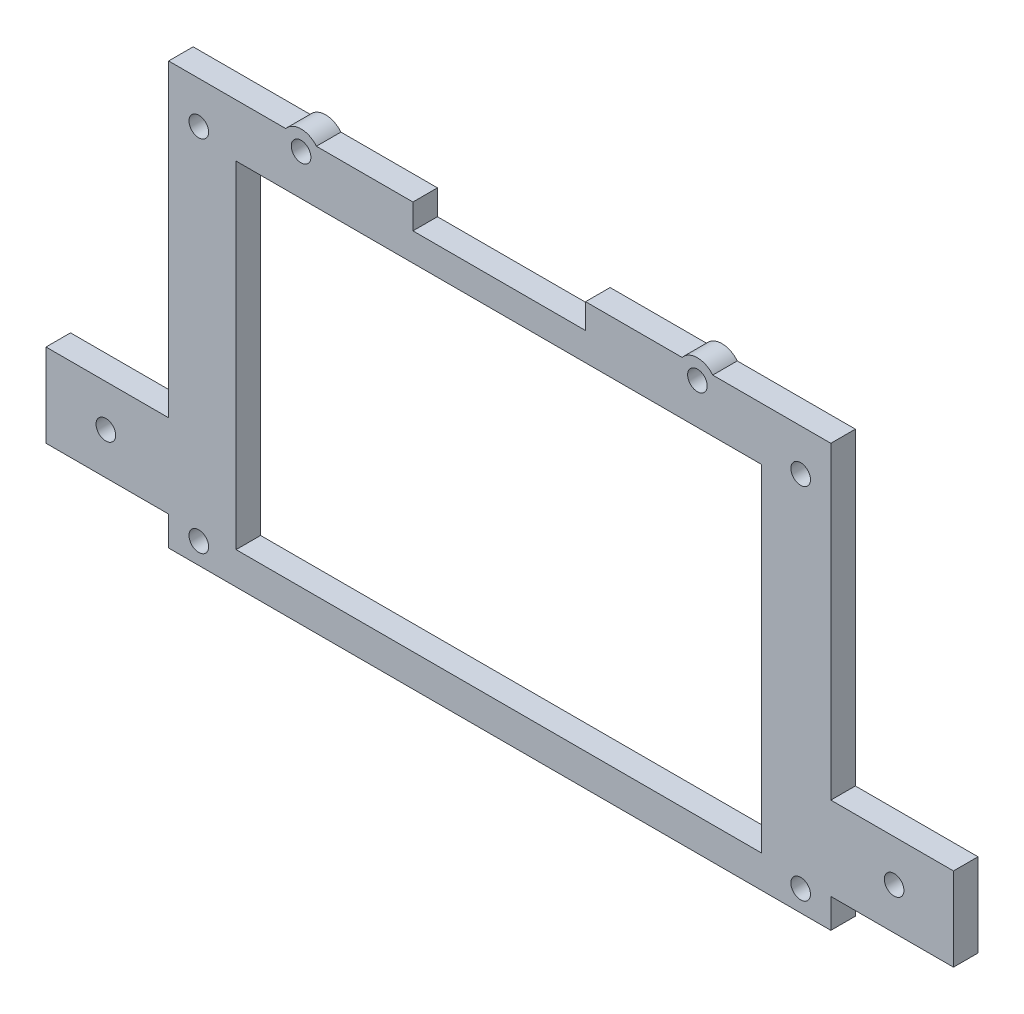
ISO-10303-21;
HEADER;
FILE_DESCRIPTION(('STEP AP214'),'2;1');
FILE_NAME('part.step','',(''),(''),'','','');
FILE_SCHEMA(('AUTOMOTIVE_DESIGN { 1 0 10303 214 1 1 1 1 }'));
ENDSEC;
DATA;
#1=APPLICATION_CONTEXT('core data for automotive mechanical design processes');
#2=APPLICATION_PROTOCOL_DEFINITION('international standard','automotive_design',2000,#1);
#3=PRODUCT_CONTEXT('',#1,'mechanical');
#4=PRODUCT('Part','Part','',(#3));
#5=PRODUCT_RELATED_PRODUCT_CATEGORY('part','',(#4));
#6=PRODUCT_DEFINITION_FORMATION('','',#4);
#7=PRODUCT_DEFINITION_CONTEXT('part definition',#1,'design');
#8=PRODUCT_DEFINITION('design','',#6,#7);
#9=PRODUCT_DEFINITION_SHAPE('','',#8);
#10=(LENGTH_UNIT() NAMED_UNIT(*) SI_UNIT(.MILLI.,.METRE.));
#11=(NAMED_UNIT(*) PLANE_ANGLE_UNIT() SI_UNIT($,.RADIAN.));
#12=(NAMED_UNIT(*) SI_UNIT($,.STERADIAN.) SOLID_ANGLE_UNIT());
#13=UNCERTAINTY_MEASURE_WITH_UNIT(LENGTH_MEASURE(1.E-05),#10,'distance_accuracy_value','');
#14=(GEOMETRIC_REPRESENTATION_CONTEXT(3) GLOBAL_UNCERTAINTY_ASSIGNED_CONTEXT((#13)) GLOBAL_UNIT_ASSIGNED_CONTEXT((#10,
#11,#12)) REPRESENTATION_CONTEXT('',''));
#15=CARTESIAN_POINT('',(0.,0.,0.));
#16=DIRECTION('',(0.,0.,1.));
#17=DIRECTION('',(1.,0.,0.));
#18=AXIS2_PLACEMENT_3D('',#15,#16,#17);
#19=CARTESIAN_POINT('',(67.5,43.,5.));
#20=DIRECTION('',(0.,-1.,0.));
#21=DIRECTION('',(1.,0.,0.));
#22=AXIS2_PLACEMENT_3D('',#19,#20,#21);
#23=PLANE('',#22);
#24=DIRECTION('',(-1.,0.,0.));
#25=VECTOR('',#24,1.);
#26=CARTESIAN_POINT('',(67.5,43.,5.));
#27=LINE('',#26,#25);
#28=CARTESIAN_POINT('',(37.1775010008051,43.,5.));
#29=VERTEX_POINT('',#28);
#30=CARTESIAN_POINT('',(17.5,43.,5.));
#31=VERTEX_POINT('',#30);
#32=EDGE_CURVE('E47',#29,#31,#27,.T.);
#33=ORIENTED_EDGE('',*,*,#32,.F.);
#34=DIRECTION('',(0.,0.,-1.));
#35=VECTOR('',#34,1.);
#36=CARTESIAN_POINT('',(37.1775010008051,43.,5.));
#37=LINE('',#36,#35);
#38=CARTESIAN_POINT('',(37.1775010008051,43.,0.));
#39=VERTEX_POINT('',#38);
#40=EDGE_CURVE('E209',#29,#39,#37,.T.);
#41=ORIENTED_EDGE('',*,*,#40,.T.);
#42=DIRECTION('',(-1.,0.,0.));
#43=VECTOR('',#42,1.);
#44=CARTESIAN_POINT('',(67.5,43.,0.));
#45=LINE('',#44,#43);
#46=CARTESIAN_POINT('',(17.5,43.,0.));
#47=VERTEX_POINT('',#46);
#48=EDGE_CURVE('E195',#39,#47,#45,.T.);
#49=ORIENTED_EDGE('',*,*,#48,.T.);
#50=DIRECTION('',(0.,0.,-1.));
#51=VECTOR('',#50,1.);
#52=CARTESIAN_POINT('',(17.5,43.,5.));
#53=LINE('',#52,#51);
#54=EDGE_CURVE('E365',#31,#47,#53,.T.);
#55=ORIENTED_EDGE('',*,*,#54,.F.);
#56=EDGE_LOOP('',(#33,#41,#49,#55));
#57=FACE_BOUND('',#56,.T.);
#58=ADVANCED_FACE('F32',(#57),#23,.F.);
#59=CARTESIAN_POINT('',(-43.622498999195,43.,5.));
#60=VERTEX_POINT('',#59);
#61=CARTESIAN_POINT('',(-67.5,43.,5.));
#62=VERTEX_POINT('',#61);
#63=EDGE_CURVE('E379',#60,#62,#27,.T.);
#64=ORIENTED_EDGE('',*,*,#63,.F.);
#65=DIRECTION('',(0.,0.,-1.));
#66=VECTOR('',#65,1.);
#67=CARTESIAN_POINT('',(-43.622498999195,43.,5.));
#68=LINE('',#67,#66);
#69=CARTESIAN_POINT('',(-43.622498999195,43.,0.));
#70=VERTEX_POINT('',#69);
#71=EDGE_CURVE('E233',#60,#70,#68,.T.);
#72=ORIENTED_EDGE('',*,*,#71,.T.);
#73=CARTESIAN_POINT('',(-67.5,43.,0.));
#74=VERTEX_POINT('',#73);
#75=EDGE_CURVE('E208',#70,#74,#45,.T.);
#76=ORIENTED_EDGE('',*,*,#75,.T.);
#77=DIRECTION('',(0.,0.,-1.));
#78=VECTOR('',#77,1.);
#79=CARTESIAN_POINT('',(-67.5,43.,5.));
#80=LINE('',#79,#78);
#81=EDGE_CURVE('E382',#62,#74,#80,.T.);
#82=ORIENTED_EDGE('',*,*,#81,.F.);
#83=EDGE_LOOP('',(#64,#72,#76,#82));
#84=FACE_BOUND('',#83,.T.);
#85=ADVANCED_FACE('F439',(#84),#23,.F.);
#86=CARTESIAN_POINT('',(67.5,-43.,5.));
#87=DIRECTION('',(-1.,0.,0.));
#88=DIRECTION('',(0.,0.,1.));
#89=AXIS2_PLACEMENT_3D('',#86,#87,#88);
#90=PLANE('',#89);
#91=DIRECTION('',(0.,0.,-1.));
#92=VECTOR('',#91,1.);
#93=CARTESIAN_POINT('',(67.5,-37.,5.));
#94=LINE('',#93,#92);
#95=CARTESIAN_POINT('',(67.5,-37.,5.));
#96=VERTEX_POINT('',#95);
#97=CARTESIAN_POINT('',(67.5,-37.,0.));
#98=VERTEX_POINT('',#97);
#99=EDGE_CURVE('E302',#96,#98,#94,.T.);
#100=ORIENTED_EDGE('',*,*,#99,.F.);
#101=DIRECTION('',(0.,1.,0.));
#102=VECTOR('',#101,1.);
#103=CARTESIAN_POINT('',(67.5,-43.,5.));
#104=LINE('',#103,#102);
#105=CARTESIAN_POINT('',(67.5,-43.,5.));
#106=VERTEX_POINT('',#105);
#107=EDGE_CURVE('E376',#106,#96,#104,.T.);
#108=ORIENTED_EDGE('',*,*,#107,.F.);
#109=DIRECTION('',(0.,0.,-1.));
#110=VECTOR('',#109,1.);
#111=CARTESIAN_POINT('',(67.5,-43.,5.));
#112=LINE('',#111,#110);
#113=CARTESIAN_POINT('',(67.5,-43.,0.));
#114=VERTEX_POINT('',#113);
#115=EDGE_CURVE('E40',#106,#114,#112,.T.);
#116=ORIENTED_EDGE('',*,*,#115,.T.);
#117=DIRECTION('',(0.,1.,0.));
#118=VECTOR('',#117,1.);
#119=CARTESIAN_POINT('',(67.5,-43.,0.));
#120=LINE('',#119,#118);
#121=EDGE_CURVE('E390',#114,#98,#120,.T.);
#122=ORIENTED_EDGE('',*,*,#121,.T.);
#123=EDGE_LOOP('',(#100,#108,#116,#122));
#124=FACE_BOUND('',#123,.T.);
#125=ADVANCED_FACE('F403',(#124),#90,.F.);
#126=CARTESIAN_POINT('',(-67.5,-43.,5.));
#127=DIRECTION('',(1.,0.,0.));
#128=DIRECTION('',(0.,0.,-1.));
#129=AXIS2_PLACEMENT_3D('',#126,#127,#128);
#130=PLANE('',#129);
#131=DIRECTION('',(0.,0.,-1.));
#132=VECTOR('',#131,1.);
#133=CARTESIAN_POINT('',(-67.5,-20.,5.));
#134=LINE('',#133,#132);
#135=CARTESIAN_POINT('',(-67.5,-20.,5.));
#136=VERTEX_POINT('',#135);
#137=CARTESIAN_POINT('',(-67.5,-20.,0.));
#138=VERTEX_POINT('',#137);
#139=EDGE_CURVE('E336',#136,#138,#134,.T.);
#140=ORIENTED_EDGE('',*,*,#139,.F.);
#141=DIRECTION('',(0.,-1.,0.));
#142=VECTOR('',#141,1.);
#143=CARTESIAN_POINT('',(-67.5,-43.,5.));
#144=LINE('',#143,#142);
#145=EDGE_CURVE('E369',#62,#136,#144,.T.);
#146=ORIENTED_EDGE('',*,*,#145,.F.);
#147=ORIENTED_EDGE('',*,*,#81,.T.);
#148=DIRECTION('',(0.,-1.,0.));
#149=VECTOR('',#148,1.);
#150=CARTESIAN_POINT('',(-67.5,-43.,0.));
#151=LINE('',#150,#149);
#152=EDGE_CURVE('E384',#74,#138,#151,.T.);
#153=ORIENTED_EDGE('',*,*,#152,.T.);
#154=EDGE_LOOP('',(#140,#146,#147,#153));
#155=FACE_BOUND('',#154,.T.);
#156=ADVANCED_FACE('F435',(#155),#130,.F.);
#157=CARTESIAN_POINT('',(-17.7,43.,0.));
#158=VERTEX_POINT('',#157);
#159=CARTESIAN_POINT('',(-37.3775010007966,43.,0.));
#160=VERTEX_POINT('',#159);
#161=EDGE_CURVE('E206',#158,#160,#45,.T.);
#162=ORIENTED_EDGE('',*,*,#161,.T.);
#163=DIRECTION('',(0.,0.,-1.));
#164=VECTOR('',#163,1.);
#165=CARTESIAN_POINT('',(-37.3775010007966,43.,5.));
#166=LINE('',#165,#164);
#167=CARTESIAN_POINT('',(-37.3775010007966,43.,5.));
#168=VERTEX_POINT('',#167);
#169=EDGE_CURVE('E229',#160,#168,#166,.F.);
#170=ORIENTED_EDGE('',*,*,#169,.T.);
#171=CARTESIAN_POINT('',(-17.7,43.,5.));
#172=VERTEX_POINT('',#171);
#173=EDGE_CURVE('E383',#172,#168,#27,.T.);
#174=ORIENTED_EDGE('',*,*,#173,.F.);
#175=DIRECTION('',(0.,0.,-1.));
#176=VECTOR('',#175,1.);
#177=CARTESIAN_POINT('',(-17.7,43.,5.));
#178=LINE('',#177,#176);
#179=EDGE_CURVE('E355',#172,#158,#178,.T.);
#180=ORIENTED_EDGE('',*,*,#179,.T.);
#181=EDGE_LOOP('',(#162,#170,#174,#180));
#182=FACE_BOUND('',#181,.T.);
#183=ADVANCED_FACE('F445',(#182),#23,.F.);
#184=CARTESIAN_POINT('',(-67.5,-37.,5.));
#185=VERTEX_POINT('',#184);
#186=CARTESIAN_POINT('',(-67.5,-43.,5.));
#187=VERTEX_POINT('',#186);
#188=EDGE_CURVE('E373',#185,#187,#144,.T.);
#189=ORIENTED_EDGE('',*,*,#188,.F.);
#190=DIRECTION('',(0.,0.,-1.));
#191=VECTOR('',#190,1.);
#192=CARTESIAN_POINT('',(-67.5,-37.,5.));
#193=LINE('',#192,#191);
#194=CARTESIAN_POINT('',(-67.5,-37.,0.));
#195=VERTEX_POINT('',#194);
#196=EDGE_CURVE('E328',#185,#195,#193,.T.);
#197=ORIENTED_EDGE('',*,*,#196,.T.);
#198=CARTESIAN_POINT('',(-67.5,-43.,0.));
#199=VERTEX_POINT('',#198);
#200=EDGE_CURVE('E362',#195,#199,#151,.T.);
#201=ORIENTED_EDGE('',*,*,#200,.T.);
#202=DIRECTION('',(0.,0.,-1.));
#203=VECTOR('',#202,1.);
#204=CARTESIAN_POINT('',(-67.5,-43.,5.));
#205=LINE('',#204,#203);
#206=EDGE_CURVE('E11',#187,#199,#205,.T.);
#207=ORIENTED_EDGE('',*,*,#206,.F.);
#208=EDGE_LOOP('',(#189,#197,#201,#207));
#209=FACE_BOUND('',#208,.T.);
#210=ADVANCED_FACE('F34',(#209),#130,.F.);
#211=CARTESIAN_POINT('',(67.5,-43.,5.));
#212=DIRECTION('',(0.,1.,0.));
#213=DIRECTION('',(-1.,0.,0.));
#214=AXIS2_PLACEMENT_3D('',#211,#212,#213);
#215=PLANE('',#214);
#216=DIRECTION('',(1.,0.,0.));
#217=VECTOR('',#216,1.);
#218=CARTESIAN_POINT('',(67.5,-43.,0.));
#219=LINE('',#218,#217);
#220=EDGE_CURVE('E387',#199,#114,#219,.T.);
#221=ORIENTED_EDGE('',*,*,#220,.T.);
#222=ORIENTED_EDGE('',*,*,#115,.F.);
#223=DIRECTION('',(1.,0.,0.));
#224=VECTOR('',#223,1.);
#225=CARTESIAN_POINT('',(67.5,-43.,5.));
#226=LINE('',#225,#224);
#227=EDGE_CURVE('E372',#187,#106,#226,.T.);
#228=ORIENTED_EDGE('',*,*,#227,.F.);
#229=ORIENTED_EDGE('',*,*,#206,.T.);
#230=EDGE_LOOP('',(#221,#222,#228,#229));
#231=FACE_BOUND('',#230,.T.);
#232=ADVANCED_FACE('F420',(#231),#215,.F.);
#233=CARTESIAN_POINT('',(67.5,-20.,5.));
#234=VERTEX_POINT('',#233);
#235=CARTESIAN_POINT('',(67.5,43.,5.));
#236=VERTEX_POINT('',#235);
#237=EDGE_CURVE('E375',#234,#236,#104,.T.);
#238=ORIENTED_EDGE('',*,*,#237,.F.);
#239=DIRECTION('',(0.,0.,-1.));
#240=VECTOR('',#239,1.);
#241=CARTESIAN_POINT('',(67.5,-20.,5.));
#242=LINE('',#241,#240);
#243=CARTESIAN_POINT('',(67.5,-20.,0.));
#244=VERTEX_POINT('',#243);
#245=EDGE_CURVE('E315',#234,#244,#242,.T.);
#246=ORIENTED_EDGE('',*,*,#245,.T.);
#247=CARTESIAN_POINT('',(67.5,43.,0.));
#248=VERTEX_POINT('',#247);
#249=EDGE_CURVE('E389',#244,#248,#120,.T.);
#250=ORIENTED_EDGE('',*,*,#249,.T.);
#251=DIRECTION('',(0.,0.,-1.));
#252=VECTOR('',#251,1.);
#253=CARTESIAN_POINT('',(67.5,43.,5.));
#254=LINE('',#253,#252);
#255=EDGE_CURVE('E395',#236,#248,#254,.T.);
#256=ORIENTED_EDGE('',*,*,#255,.F.);
#257=EDGE_LOOP('',(#238,#246,#250,#256));
#258=FACE_BOUND('',#257,.T.);
#259=ADVANCED_FACE('F480',(#258),#90,.F.);
#260=CARTESIAN_POINT('',(43.4224989992034,43.,0.));
#261=VERTEX_POINT('',#260);
#262=EDGE_CURVE('E205',#248,#261,#45,.T.);
#263=ORIENTED_EDGE('',*,*,#262,.T.);
#264=DIRECTION('',(0.,0.,-1.));
#265=VECTOR('',#264,1.);
#266=CARTESIAN_POINT('',(43.4224989992034,43.,5.));
#267=LINE('',#266,#265);
#268=CARTESIAN_POINT('',(43.4224989992034,43.,5.));
#269=VERTEX_POINT('',#268);
#270=EDGE_CURVE('E55',#261,#269,#267,.F.);
#271=ORIENTED_EDGE('',*,*,#270,.T.);
#272=EDGE_CURVE('E380',#236,#269,#27,.T.);
#273=ORIENTED_EDGE('',*,*,#272,.F.);
#274=ORIENTED_EDGE('',*,*,#255,.T.);
#275=EDGE_LOOP('',(#263,#271,#273,#274));
#276=FACE_BOUND('',#275,.T.);
#277=ADVANCED_FACE('F474',(#276),#23,.F.);
#278=CARTESIAN_POINT('',(0.,0.,5.));
#279=DIRECTION('',(0.,0.,1.));
#280=DIRECTION('',(1.,0.,0.));
#281=AXIS2_PLACEMENT_3D('',#278,#279,#280);
#282=PLANE('',#281);
#283=CARTESIAN_POINT('',(-61.3499999999982,34.4999999999999,5.));
#284=DIRECTION('',(0.,0.,-1.));
#285=DIRECTION('',(-1.,0.,0.));
#286=AXIS2_PLACEMENT_3D('',#283,#284,#285);
#287=CIRCLE('',#286,2.);
#288=CARTESIAN_POINT('',(-63.3499999999982,34.4999999999999,5.));
#289=VERTEX_POINT('',#288);
#290=EDGE_CURVE('E782',#289,#289,#287,.T.);
#291=ORIENTED_EDGE('',*,*,#290,.T.);
#292=EDGE_LOOP('',(#291));
#293=FACE_BOUND('',#292,.T.);
#294=CARTESIAN_POINT('',(61.3500000000018,34.4999999999999,5.));
#295=DIRECTION('',(0.,0.,-1.));
#296=DIRECTION('',(-1.,0.,0.));
#297=AXIS2_PLACEMENT_3D('',#294,#295,#296);
#298=CIRCLE('',#297,2.);
#299=CARTESIAN_POINT('',(59.3500000000018,34.4999999999999,5.));
#300=VERTEX_POINT('',#299);
#301=EDGE_CURVE('E800',#300,#300,#298,.T.);
#302=ORIENTED_EDGE('',*,*,#301,.T.);
#303=EDGE_LOOP('',(#302));
#304=FACE_BOUND('',#303,.T.);
#305=CARTESIAN_POINT('',(61.3500000000017,-38.7000000000001,5.));
#306=DIRECTION('',(0.,0.,-1.));
#307=DIRECTION('',(-1.,0.,0.));
#308=AXIS2_PLACEMENT_3D('',#305,#306,#307);
#309=CIRCLE('',#308,2.);
#310=CARTESIAN_POINT('',(59.3500000000017,-38.7000000000001,5.));
#311=VERTEX_POINT('',#310);
#312=EDGE_CURVE('E791',#311,#311,#309,.T.);
#313=ORIENTED_EDGE('',*,*,#312,.T.);
#314=EDGE_LOOP('',(#313));
#315=FACE_BOUND('',#314,.T.);
#316=CARTESIAN_POINT('',(-61.3499999999982,-38.7000000000001,5.));
#317=DIRECTION('',(0.,0.,-1.));
#318=DIRECTION('',(-1.,0.,0.));
#319=AXIS2_PLACEMENT_3D('',#316,#317,#318);
#320=CIRCLE('',#319,2.);
#321=CARTESIAN_POINT('',(-63.3499999999982,-38.7000000000001,5.));
#322=VERTEX_POINT('',#321);
#323=EDGE_CURVE('E217',#322,#322,#320,.T.);
#324=ORIENTED_EDGE('',*,*,#323,.T.);
#325=EDGE_LOOP('',(#324));
#326=FACE_BOUND('',#325,.T.);
#327=ORIENTED_EDGE('',*,*,#272,.T.);
#328=CARTESIAN_POINT('',(40.3000000000042,40.4999999999999,5.));
#329=DIRECTION('',(0.,0.,-1.));
#330=DIRECTION('',(-1.,0.,0.));
#331=AXIS2_PLACEMENT_3D('',#328,#329,#330);
#332=CIRCLE('',#331,4.);
#333=EDGE_CURVE('E216',#29,#269,#332,.T.);
#334=ORIENTED_EDGE('',*,*,#333,.F.);
#335=ORIENTED_EDGE('',*,*,#32,.T.);
#336=DIRECTION('',(0.,-1.,0.));
#337=VECTOR('',#336,1.);
#338=CARTESIAN_POINT('',(17.5,43.,5.));
#339=LINE('',#338,#337);
#340=CARTESIAN_POINT('',(17.5,37.9,5.));
#341=VERTEX_POINT('',#340);
#342=EDGE_CURVE('E348',#31,#341,#339,.T.);
#343=ORIENTED_EDGE('',*,*,#342,.T.);
#344=DIRECTION('',(-1.,0.,0.));
#345=VECTOR('',#344,1.);
#346=CARTESIAN_POINT('',(17.5,37.9,5.));
#347=LINE('',#346,#345);
#348=CARTESIAN_POINT('',(-17.7,37.9,5.));
#349=VERTEX_POINT('',#348);
#350=EDGE_CURVE('E352',#341,#349,#347,.T.);
#351=ORIENTED_EDGE('',*,*,#350,.T.);
#352=DIRECTION('',(0.,1.,0.));
#353=VECTOR('',#352,1.);
#354=CARTESIAN_POINT('',(-17.7,37.9,5.));
#355=LINE('',#354,#353);
#356=EDGE_CURVE('E345',#349,#172,#355,.T.);
#357=ORIENTED_EDGE('',*,*,#356,.T.);
#358=ORIENTED_EDGE('',*,*,#173,.T.);
#359=CARTESIAN_POINT('',(-40.4999999999958,40.4999999999999,5.));
#360=DIRECTION('',(0.,0.,-1.));
#361=DIRECTION('',(-1.,0.,0.));
#362=AXIS2_PLACEMENT_3D('',#359,#360,#361);
#363=CIRCLE('',#362,4.00000000000001);
#364=EDGE_CURVE('E226',#60,#168,#363,.T.);
#365=ORIENTED_EDGE('',*,*,#364,.F.);
#366=ORIENTED_EDGE('',*,*,#63,.T.);
#367=ORIENTED_EDGE('',*,*,#145,.T.);
#368=DIRECTION('',(1.,0.,0.));
#369=VECTOR('',#368,1.);
#370=CARTESIAN_POINT('',(-67.5,-20.,5.));
#371=LINE('',#370,#369);
#372=CARTESIAN_POINT('',(-92.5,-20.,5.));
#373=VERTEX_POINT('',#372);
#374=EDGE_CURVE('E326',#373,#136,#371,.T.);
#375=ORIENTED_EDGE('',*,*,#374,.F.);
#376=DIRECTION('',(0.,1.,0.));
#377=VECTOR('',#376,1.);
#378=CARTESIAN_POINT('',(-92.5,-37.,5.));
#379=LINE('',#378,#377);
#380=CARTESIAN_POINT('',(-92.5,-37.,5.));
#381=VERTEX_POINT('',#380);
#382=EDGE_CURVE('E322',#381,#373,#379,.T.);
#383=ORIENTED_EDGE('',*,*,#382,.F.);
#384=DIRECTION('',(-1.,0.,0.));
#385=VECTOR('',#384,1.);
#386=CARTESIAN_POINT('',(-67.5,-37.,5.));
#387=LINE('',#386,#385);
#388=EDGE_CURVE('E319',#185,#381,#387,.T.);
#389=ORIENTED_EDGE('',*,*,#388,.F.);
#390=ORIENTED_EDGE('',*,*,#188,.T.);
#391=ORIENTED_EDGE('',*,*,#227,.T.);
#392=ORIENTED_EDGE('',*,*,#107,.T.);
#393=DIRECTION('',(-1.,0.,0.));
#394=VECTOR('',#393,1.);
#395=CARTESIAN_POINT('',(67.5,-37.,5.));
#396=LINE('',#395,#394);
#397=CARTESIAN_POINT('',(92.5,-37.,5.));
#398=VERTEX_POINT('',#397);
#399=EDGE_CURVE('E293',#398,#96,#396,.T.);
#400=ORIENTED_EDGE('',*,*,#399,.F.);
#401=DIRECTION('',(0.,-1.,0.));
#402=VECTOR('',#401,1.);
#403=CARTESIAN_POINT('',(92.5,-37.,5.));
#404=LINE('',#403,#402);
#405=CARTESIAN_POINT('',(92.5,-20.,5.));
#406=VERTEX_POINT('',#405);
#407=EDGE_CURVE('E299',#406,#398,#404,.T.);
#408=ORIENTED_EDGE('',*,*,#407,.F.);
#409=DIRECTION('',(1.,0.,0.));
#410=VECTOR('',#409,1.);
#411=CARTESIAN_POINT('',(67.5,-20.,5.));
#412=LINE('',#411,#410);
#413=EDGE_CURVE('E295',#234,#406,#412,.T.);
#414=ORIENTED_EDGE('',*,*,#413,.F.);
#415=ORIENTED_EDGE('',*,*,#237,.T.);
#416=EDGE_LOOP('',(#327,#334,#335,#343,#351,#357,#358,#365,#366,#367,#375,#383,#389,#390,#391,
#392,#400,#408,#414,#415));
#417=FACE_BOUND('',#416,.T.);
#418=CARTESIAN_POINT('',(-80.3000000000001,-28.5000000000001,5.));
#419=DIRECTION('',(0.,0.,1.));
#420=DIRECTION('',(1.,0.,0.));
#421=AXIS2_PLACEMENT_3D('',#418,#419,#420);
#422=CIRCLE('',#421,2.);
#423=CARTESIAN_POINT('',(-78.3000000000001,-28.5000000000001,5.));
#424=VERTEX_POINT('',#423);
#425=EDGE_CURVE('E254',#424,#424,#422,.T.);
#426=ORIENTED_EDGE('',*,*,#425,.F.);
#427=EDGE_LOOP('',(#426));
#428=FACE_BOUND('',#427,.T.);
#429=CARTESIAN_POINT('',(80.3999999999999,-28.5000000000001,5.));
#430=DIRECTION('',(0.,0.,1.));
#431=DIRECTION('',(1.,0.,0.));
#432=AXIS2_PLACEMENT_3D('',#429,#430,#431);
#433=CIRCLE('',#432,2.);
#434=CARTESIAN_POINT('',(82.3999999999999,-28.5000000000001,5.));
#435=VERTEX_POINT('',#434);
#436=EDGE_CURVE('E251',#435,#435,#433,.T.);
#437=ORIENTED_EDGE('',*,*,#436,.F.);
#438=EDGE_LOOP('',(#437));
#439=FACE_BOUND('',#438,.T.);
#440=DIRECTION('',(1.,0.,0.));
#441=VECTOR('',#440,1.);
#442=CARTESIAN_POINT('',(-53.75,32.2,5.));
#443=LINE('',#442,#441);
#444=CARTESIAN_POINT('',(-53.75,32.2,5.));
#445=VERTEX_POINT('',#444);
#446=CARTESIAN_POINT('',(53.35,32.2,5.));
#447=VERTEX_POINT('',#446);
#448=EDGE_CURVE('E261',#445,#447,#443,.T.);
#449=ORIENTED_EDGE('',*,*,#448,.T.);
#450=DIRECTION('',(0.,-1.,0.));
#451=VECTOR('',#450,1.);
#452=CARTESIAN_POINT('',(53.35,32.2,5.));
#453=LINE('',#452,#451);
#454=CARTESIAN_POINT('',(53.35,-36.4,5.));
#455=VERTEX_POINT('',#454);
#456=EDGE_CURVE('E264',#447,#455,#453,.T.);
#457=ORIENTED_EDGE('',*,*,#456,.T.);
#458=DIRECTION('',(-1.,0.,0.));
#459=VECTOR('',#458,1.);
#460=CARTESIAN_POINT('',(53.35,-36.4,5.));
#461=LINE('',#460,#459);
#462=CARTESIAN_POINT('',(-53.75,-36.4,5.));
#463=VERTEX_POINT('',#462);
#464=EDGE_CURVE('E268',#455,#463,#461,.T.);
#465=ORIENTED_EDGE('',*,*,#464,.T.);
#466=DIRECTION('',(0.,1.,0.));
#467=VECTOR('',#466,1.);
#468=CARTESIAN_POINT('',(-53.75,-36.4,5.));
#469=LINE('',#468,#467);
#470=EDGE_CURVE('E271',#463,#445,#469,.T.);
#471=ORIENTED_EDGE('',*,*,#470,.T.);
#472=EDGE_LOOP('',(#449,#457,#465,#471));
#473=FACE_BOUND('',#472,.T.);
#474=CARTESIAN_POINT('',(-40.4999999999958,40.4999999999999,5.));
#475=DIRECTION('',(0.,0.,1.));
#476=DIRECTION('',(1.,0.,0.));
#477=AXIS2_PLACEMENT_3D('',#474,#475,#476);
#478=CIRCLE('',#477,2.);
#479=CARTESIAN_POINT('',(-38.4999999999958,40.4999999999999,5.));
#480=VERTEX_POINT('',#479);
#481=EDGE_CURVE('E257',#480,#480,#478,.T.);
#482=ORIENTED_EDGE('',*,*,#481,.F.);
#483=EDGE_LOOP('',(#482));
#484=FACE_BOUND('',#483,.T.);
#485=CARTESIAN_POINT('',(40.3000000000042,40.4999999999999,5.));
#486=DIRECTION('',(0.,0.,1.));
#487=DIRECTION('',(1.,0.,0.));
#488=AXIS2_PLACEMENT_3D('',#485,#486,#487);
#489=CIRCLE('',#488,2.);
#490=CARTESIAN_POINT('',(42.3000000000042,40.4999999999999,5.));
#491=VERTEX_POINT('',#490);
#492=EDGE_CURVE('E248',#491,#491,#489,.T.);
#493=ORIENTED_EDGE('',*,*,#492,.F.);
#494=EDGE_LOOP('',(#493));
#495=FACE_BOUND('',#494,.T.);
#496=ADVANCED_FACE('F414',(#293,#304,#315,#326,#417,#428,#439,#473,#484,#495),#282,.T.);
#497=CARTESIAN_POINT('',(0.,0.,0.));
#498=DIRECTION('',(0.,0.,1.));
#499=DIRECTION('',(1.,0.,0.));
#500=AXIS2_PLACEMENT_3D('',#497,#498,#499);
#501=PLANE('',#500);
#502=CARTESIAN_POINT('',(-61.3499999999982,34.4999999999999,0.));
#503=DIRECTION('',(0.,0.,-1.));
#504=DIRECTION('',(-1.,0.,0.));
#505=AXIS2_PLACEMENT_3D('',#502,#503,#504);
#506=CIRCLE('',#505,2.);
#507=CARTESIAN_POINT('',(-63.3499999999982,34.4999999999999,0.));
#508=VERTEX_POINT('',#507);
#509=EDGE_CURVE('E785',#508,#508,#506,.T.);
#510=ORIENTED_EDGE('',*,*,#509,.F.);
#511=EDGE_LOOP('',(#510));
#512=FACE_BOUND('',#511,.T.);
#513=CARTESIAN_POINT('',(61.3500000000018,34.4999999999999,0.));
#514=DIRECTION('',(0.,0.,-1.));
#515=DIRECTION('',(-1.,0.,0.));
#516=AXIS2_PLACEMENT_3D('',#513,#514,#515);
#517=CIRCLE('',#516,2.);
#518=CARTESIAN_POINT('',(59.3500000000018,34.4999999999999,0.));
#519=VERTEX_POINT('',#518);
#520=EDGE_CURVE('E787',#519,#519,#517,.T.);
#521=ORIENTED_EDGE('',*,*,#520,.F.);
#522=EDGE_LOOP('',(#521));
#523=FACE_BOUND('',#522,.T.);
#524=CARTESIAN_POINT('',(61.3500000000017,-38.7000000000001,0.));
#525=DIRECTION('',(0.,0.,-1.));
#526=DIRECTION('',(-1.,0.,0.));
#527=AXIS2_PLACEMENT_3D('',#524,#525,#526);
#528=CIRCLE('',#527,2.);
#529=CARTESIAN_POINT('',(59.3500000000017,-38.7000000000001,0.));
#530=VERTEX_POINT('',#529);
#531=EDGE_CURVE('E795',#530,#530,#528,.T.);
#532=ORIENTED_EDGE('',*,*,#531,.F.);
#533=EDGE_LOOP('',(#532));
#534=FACE_BOUND('',#533,.T.);
#535=CARTESIAN_POINT('',(-61.3499999999982,-38.7000000000001,0.));
#536=DIRECTION('',(0.,0.,-1.));
#537=DIRECTION('',(-1.,0.,0.));
#538=AXIS2_PLACEMENT_3D('',#535,#536,#537);
#539=CIRCLE('',#538,2.);
#540=CARTESIAN_POINT('',(-63.3499999999982,-38.7000000000001,0.));
#541=VERTEX_POINT('',#540);
#542=EDGE_CURVE('E221',#541,#541,#539,.T.);
#543=ORIENTED_EDGE('',*,*,#542,.F.);
#544=EDGE_LOOP('',(#543));
#545=FACE_BOUND('',#544,.T.);
#546=CARTESIAN_POINT('',(-80.3000000000001,-28.5000000000001,0.));
#547=DIRECTION('',(0.,0.,-1.));
#548=DIRECTION('',(-1.,0.,0.));
#549=AXIS2_PLACEMENT_3D('',#546,#547,#548);
#550=CIRCLE('',#549,2.);
#551=CARTESIAN_POINT('',(-82.3000000000001,-28.5000000000001,0.));
#552=VERTEX_POINT('',#551);
#553=EDGE_CURVE('E241',#552,#552,#550,.T.);
#554=ORIENTED_EDGE('',*,*,#553,.F.);
#555=EDGE_LOOP('',(#554));
#556=FACE_BOUND('',#555,.T.);
#557=CARTESIAN_POINT('',(80.3999999999999,-28.5000000000001,0.));
#558=DIRECTION('',(0.,0.,-1.));
#559=DIRECTION('',(-1.,0.,0.));
#560=AXIS2_PLACEMENT_3D('',#557,#558,#559);
#561=CIRCLE('',#560,2.);
#562=CARTESIAN_POINT('',(78.3999999999999,-28.5000000000001,0.));
#563=VERTEX_POINT('',#562);
#564=EDGE_CURVE('E237',#563,#563,#561,.T.);
#565=ORIENTED_EDGE('',*,*,#564,.F.);
#566=EDGE_LOOP('',(#565));
#567=FACE_BOUND('',#566,.T.);
#568=DIRECTION('',(0.,-1.,0.));
#569=VECTOR('',#568,1.);
#570=CARTESIAN_POINT('',(53.35,32.2,0.));
#571=LINE('',#570,#569);
#572=CARTESIAN_POINT('',(53.35,32.2,0.));
#573=VERTEX_POINT('',#572);
#574=CARTESIAN_POINT('',(53.35,-36.4,0.));
#575=VERTEX_POINT('',#574);
#576=EDGE_CURVE('E276',#573,#575,#571,.T.);
#577=ORIENTED_EDGE('',*,*,#576,.F.);
#578=DIRECTION('',(1.,0.,0.));
#579=VECTOR('',#578,1.);
#580=CARTESIAN_POINT('',(-53.75,32.2,0.));
#581=LINE('',#580,#579);
#582=CARTESIAN_POINT('',(-53.75,32.2,0.));
#583=VERTEX_POINT('',#582);
#584=EDGE_CURVE('E260',#583,#573,#581,.T.);
#585=ORIENTED_EDGE('',*,*,#584,.F.);
#586=DIRECTION('',(0.,1.,0.));
#587=VECTOR('',#586,1.);
#588=CARTESIAN_POINT('',(-53.75,-36.4,0.));
#589=LINE('',#588,#587);
#590=CARTESIAN_POINT('',(-53.75,-36.4,0.));
#591=VERTEX_POINT('',#590);
#592=EDGE_CURVE('E265',#591,#583,#589,.T.);
#593=ORIENTED_EDGE('',*,*,#592,.F.);
#594=DIRECTION('',(-1.,0.,0.));
#595=VECTOR('',#594,1.);
#596=CARTESIAN_POINT('',(53.35,-36.4,0.));
#597=LINE('',#596,#595);
#598=EDGE_CURVE('E279',#575,#591,#597,.T.);
#599=ORIENTED_EDGE('',*,*,#598,.F.);
#600=EDGE_LOOP('',(#577,#585,#593,#599));
#601=FACE_BOUND('',#600,.T.);
#602=ORIENTED_EDGE('',*,*,#48,.F.);
#603=CARTESIAN_POINT('',(40.3000000000042,40.4999999999999,0.));
#604=DIRECTION('',(0.,0.,-1.));
#605=DIRECTION('',(-1.,0.,0.));
#606=AXIS2_PLACEMENT_3D('',#603,#604,#605);
#607=CIRCLE('',#606,4.);
#608=EDGE_CURVE('E200',#39,#261,#607,.T.);
#609=ORIENTED_EDGE('',*,*,#608,.T.);
#610=ORIENTED_EDGE('',*,*,#262,.F.);
#611=ORIENTED_EDGE('',*,*,#249,.F.);
#612=DIRECTION('',(1.,0.,0.));
#613=VECTOR('',#612,1.);
#614=CARTESIAN_POINT('',(67.5,-20.,0.));
#615=LINE('',#614,#613);
#616=CARTESIAN_POINT('',(92.5,-20.,0.));
#617=VERTEX_POINT('',#616);
#618=EDGE_CURVE('E305',#244,#617,#615,.T.);
#619=ORIENTED_EDGE('',*,*,#618,.T.);
#620=DIRECTION('',(0.,-1.,0.));
#621=VECTOR('',#620,1.);
#622=CARTESIAN_POINT('',(92.5,-37.,0.));
#623=LINE('',#622,#621);
#624=CARTESIAN_POINT('',(92.5,-37.,0.));
#625=VERTEX_POINT('',#624);
#626=EDGE_CURVE('E296',#617,#625,#623,.T.);
#627=ORIENTED_EDGE('',*,*,#626,.T.);
#628=DIRECTION('',(-1.,0.,0.));
#629=VECTOR('',#628,1.);
#630=CARTESIAN_POINT('',(67.5,-37.,0.));
#631=LINE('',#630,#629);
#632=EDGE_CURVE('E286',#625,#98,#631,.T.);
#633=ORIENTED_EDGE('',*,*,#632,.T.);
#634=ORIENTED_EDGE('',*,*,#121,.F.);
#635=ORIENTED_EDGE('',*,*,#220,.F.);
#636=ORIENTED_EDGE('',*,*,#200,.F.);
#637=DIRECTION('',(-1.,0.,0.));
#638=VECTOR('',#637,1.);
#639=CARTESIAN_POINT('',(-67.5,-37.,0.));
#640=LINE('',#639,#638);
#641=CARTESIAN_POINT('',(-92.5,-37.,0.));
#642=VERTEX_POINT('',#641);
#643=EDGE_CURVE('E312',#195,#642,#640,.T.);
#644=ORIENTED_EDGE('',*,*,#643,.T.);
#645=DIRECTION('',(0.,1.,0.));
#646=VECTOR('',#645,1.);
#647=CARTESIAN_POINT('',(-92.5,-37.,0.));
#648=LINE('',#647,#646);
#649=CARTESIAN_POINT('',(-92.5,-20.,0.));
#650=VERTEX_POINT('',#649);
#651=EDGE_CURVE('E331',#642,#650,#648,.T.);
#652=ORIENTED_EDGE('',*,*,#651,.T.);
#653=DIRECTION('',(1.,0.,0.));
#654=VECTOR('',#653,1.);
#655=CARTESIAN_POINT('',(-67.5,-20.,0.));
#656=LINE('',#655,#654);
#657=EDGE_CURVE('E323',#650,#138,#656,.T.);
#658=ORIENTED_EDGE('',*,*,#657,.T.);
#659=ORIENTED_EDGE('',*,*,#152,.F.);
#660=ORIENTED_EDGE('',*,*,#75,.F.);
#661=CARTESIAN_POINT('',(-40.4999999999958,40.4999999999999,0.));
#662=DIRECTION('',(0.,0.,-1.));
#663=DIRECTION('',(-1.,0.,0.));
#664=AXIS2_PLACEMENT_3D('',#661,#662,#663);
#665=CIRCLE('',#664,4.00000000000001);
#666=EDGE_CURVE('E213',#70,#160,#665,.T.);
#667=ORIENTED_EDGE('',*,*,#666,.T.);
#668=ORIENTED_EDGE('',*,*,#161,.F.);
#669=DIRECTION('',(0.,1.,0.));
#670=VECTOR('',#669,1.);
#671=CARTESIAN_POINT('',(-17.7,37.9,0.));
#672=LINE('',#671,#670);
#673=CARTESIAN_POINT('',(-17.7,37.9,0.));
#674=VERTEX_POINT('',#673);
#675=EDGE_CURVE('E338',#674,#158,#672,.T.);
#676=ORIENTED_EDGE('',*,*,#675,.F.);
#677=DIRECTION('',(-1.,0.,0.));
#678=VECTOR('',#677,1.);
#679=CARTESIAN_POINT('',(17.5,37.9,0.));
#680=LINE('',#679,#678);
#681=CARTESIAN_POINT('',(17.5,37.9,0.));
#682=VERTEX_POINT('',#681);
#683=EDGE_CURVE('E349',#682,#674,#680,.T.);
#684=ORIENTED_EDGE('',*,*,#683,.F.);
#685=DIRECTION('',(0.,-1.,0.));
#686=VECTOR('',#685,1.);
#687=CARTESIAN_POINT('',(17.5,43.,0.));
#688=LINE('',#687,#686);
#689=EDGE_CURVE('E203',#47,#682,#688,.T.);
#690=ORIENTED_EDGE('',*,*,#689,.F.);
#691=EDGE_LOOP('',(#602,#609,#610,#611,#619,#627,#633,#634,#635,#636,#644,#652,#658,#659,#660,
#667,#668,#676,#684,#690));
#692=FACE_BOUND('',#691,.T.);
#693=CARTESIAN_POINT('',(-40.4999999999958,40.4999999999999,0.));
#694=DIRECTION('',(0.,0.,-1.));
#695=DIRECTION('',(-1.,0.,0.));
#696=AXIS2_PLACEMENT_3D('',#693,#694,#695);
#697=CIRCLE('',#696,2.);
#698=CARTESIAN_POINT('',(-42.4999999999958,40.4999999999999,0.));
#699=VERTEX_POINT('',#698);
#700=EDGE_CURVE('E236',#699,#699,#697,.T.);
#701=ORIENTED_EDGE('',*,*,#700,.F.);
#702=EDGE_LOOP('',(#701));
#703=FACE_BOUND('',#702,.T.);
#704=CARTESIAN_POINT('',(40.3000000000042,40.4999999999999,0.));
#705=DIRECTION('',(0.,0.,-1.));
#706=DIRECTION('',(-1.,0.,0.));
#707=AXIS2_PLACEMENT_3D('',#704,#705,#706);
#708=CIRCLE('',#707,2.);
#709=CARTESIAN_POINT('',(38.3000000000042,40.4999999999999,0.));
#710=VERTEX_POINT('',#709);
#711=EDGE_CURVE('E240',#710,#710,#708,.T.);
#712=ORIENTED_EDGE('',*,*,#711,.F.);
#713=EDGE_LOOP('',(#712));
#714=FACE_BOUND('',#713,.T.);
#715=ADVANCED_FACE('F196',(#512,#523,#534,#545,#556,#567,#601,#692,#703,#714),#501,.F.);
#716=CARTESIAN_POINT('',(-17.7,37.9,5.));
#717=DIRECTION('',(-1.,0.,0.));
#718=DIRECTION('',(0.,-1.,0.));
#719=AXIS2_PLACEMENT_3D('',#716,#717,#718);
#720=PLANE('',#719);
#721=ORIENTED_EDGE('',*,*,#675,.T.);
#722=ORIENTED_EDGE('',*,*,#179,.F.);
#723=ORIENTED_EDGE('',*,*,#356,.F.);
#724=DIRECTION('',(0.,0.,-1.));
#725=VECTOR('',#724,1.);
#726=CARTESIAN_POINT('',(-17.7,37.9,5.));
#727=LINE('',#726,#725);
#728=EDGE_CURVE('E360',#349,#674,#727,.T.);
#729=ORIENTED_EDGE('',*,*,#728,.T.);
#730=EDGE_LOOP('',(#721,#722,#723,#729));
#731=FACE_BOUND('',#730,.T.);
#732=ADVANCED_FACE('F460',(#731),#720,.F.);
#733=CARTESIAN_POINT('',(17.5,37.9,5.));
#734=DIRECTION('',(0.,-1.,0.));
#735=DIRECTION('',(1.,0.,0.));
#736=AXIS2_PLACEMENT_3D('',#733,#734,#735);
#737=PLANE('',#736);
#738=ORIENTED_EDGE('',*,*,#683,.T.);
#739=ORIENTED_EDGE('',*,*,#728,.F.);
#740=ORIENTED_EDGE('',*,*,#350,.F.);
#741=DIRECTION('',(0.,0.,-1.));
#742=VECTOR('',#741,1.);
#743=CARTESIAN_POINT('',(17.5,37.9,5.));
#744=LINE('',#743,#742);
#745=EDGE_CURVE('E363',#341,#682,#744,.T.);
#746=ORIENTED_EDGE('',*,*,#745,.T.);
#747=EDGE_LOOP('',(#738,#739,#740,#746));
#748=FACE_BOUND('',#747,.T.);
#749=ADVANCED_FACE('F458',(#748),#737,.F.);
#750=CARTESIAN_POINT('',(17.5,43.,5.));
#751=DIRECTION('',(1.,0.,0.));
#752=DIRECTION('',(0.,1.,0.));
#753=AXIS2_PLACEMENT_3D('',#750,#751,#752);
#754=PLANE('',#753);
#755=ORIENTED_EDGE('',*,*,#689,.T.);
#756=ORIENTED_EDGE('',*,*,#745,.F.);
#757=ORIENTED_EDGE('',*,*,#342,.F.);
#758=ORIENTED_EDGE('',*,*,#54,.T.);
#759=EDGE_LOOP('',(#755,#756,#757,#758));
#760=FACE_BOUND('',#759,.T.);
#761=ADVANCED_FACE('F455',(#760),#754,.F.);
#762=CARTESIAN_POINT('',(-67.5,-20.,5.));
#763=DIRECTION('',(0.,1.,0.));
#764=DIRECTION('',(0.,0.,1.));
#765=AXIS2_PLACEMENT_3D('',#762,#763,#764);
#766=PLANE('',#765);
#767=ORIENTED_EDGE('',*,*,#657,.F.);
#768=DIRECTION('',(0.,0.,-1.));
#769=VECTOR('',#768,1.);
#770=CARTESIAN_POINT('',(-92.5,-20.,5.));
#771=LINE('',#770,#769);
#772=EDGE_CURVE('E339',#373,#650,#771,.T.);
#773=ORIENTED_EDGE('',*,*,#772,.F.);
#774=ORIENTED_EDGE('',*,*,#374,.T.);
#775=ORIENTED_EDGE('',*,*,#139,.T.);
#776=EDGE_LOOP('',(#767,#773,#774,#775));
#777=FACE_BOUND('',#776,.T.);
#778=ADVANCED_FACE('F431',(#777),#766,.T.);
#779=CARTESIAN_POINT('',(-92.5,-37.,5.));
#780=DIRECTION('',(-1.,0.,0.));
#781=DIRECTION('',(0.,0.,1.));
#782=AXIS2_PLACEMENT_3D('',#779,#780,#781);
#783=PLANE('',#782);
#784=ORIENTED_EDGE('',*,*,#651,.F.);
#785=DIRECTION('',(0.,0.,-1.));
#786=VECTOR('',#785,1.);
#787=CARTESIAN_POINT('',(-92.5,-37.,5.));
#788=LINE('',#787,#786);
#789=EDGE_CURVE('E341',#381,#642,#788,.T.);
#790=ORIENTED_EDGE('',*,*,#789,.F.);
#791=ORIENTED_EDGE('',*,*,#382,.T.);
#792=ORIENTED_EDGE('',*,*,#772,.T.);
#793=EDGE_LOOP('',(#784,#790,#791,#792));
#794=FACE_BOUND('',#793,.T.);
#795=ADVANCED_FACE('F428',(#794),#783,.T.);
#796=CARTESIAN_POINT('',(-67.5,-37.,5.));
#797=DIRECTION('',(0.,-1.,0.));
#798=DIRECTION('',(0.,0.,-1.));
#799=AXIS2_PLACEMENT_3D('',#796,#797,#798);
#800=PLANE('',#799);
#801=ORIENTED_EDGE('',*,*,#643,.F.);
#802=ORIENTED_EDGE('',*,*,#196,.F.);
#803=ORIENTED_EDGE('',*,*,#388,.T.);
#804=ORIENTED_EDGE('',*,*,#789,.T.);
#805=EDGE_LOOP('',(#801,#802,#803,#804));
#806=FACE_BOUND('',#805,.T.);
#807=ADVANCED_FACE('F425',(#806),#800,.T.);
#808=CARTESIAN_POINT('',(67.5,-37.,5.));
#809=DIRECTION('',(0.,-1.,0.));
#810=DIRECTION('',(1.,0.,0.));
#811=AXIS2_PLACEMENT_3D('',#808,#809,#810);
#812=PLANE('',#811);
#813=ORIENTED_EDGE('',*,*,#632,.F.);
#814=DIRECTION('',(0.,0.,-1.));
#815=VECTOR('',#814,1.);
#816=CARTESIAN_POINT('',(92.5,-37.,5.));
#817=LINE('',#816,#815);
#818=EDGE_CURVE('E310',#398,#625,#817,.T.);
#819=ORIENTED_EDGE('',*,*,#818,.F.);
#820=ORIENTED_EDGE('',*,*,#399,.T.);
#821=ORIENTED_EDGE('',*,*,#99,.T.);
#822=EDGE_LOOP('',(#813,#819,#820,#821));
#823=FACE_BOUND('',#822,.T.);
#824=ADVANCED_FACE('F411',(#823),#812,.T.);
#825=CARTESIAN_POINT('',(92.5,-37.,5.));
#826=DIRECTION('',(1.,0.,0.));
#827=DIRECTION('',(0.,0.,-1.));
#828=AXIS2_PLACEMENT_3D('',#825,#826,#827);
#829=PLANE('',#828);
#830=ORIENTED_EDGE('',*,*,#626,.F.);
#831=DIRECTION('',(0.,0.,-1.));
#832=VECTOR('',#831,1.);
#833=CARTESIAN_POINT('',(92.5,-20.,5.));
#834=LINE('',#833,#832);
#835=EDGE_CURVE('E313',#406,#617,#834,.T.);
#836=ORIENTED_EDGE('',*,*,#835,.F.);
#837=ORIENTED_EDGE('',*,*,#407,.T.);
#838=ORIENTED_EDGE('',*,*,#818,.T.);
#839=EDGE_LOOP('',(#830,#836,#837,#838));
#840=FACE_BOUND('',#839,.T.);
#841=ADVANCED_FACE('F544',(#840),#829,.T.);
#842=CARTESIAN_POINT('',(67.5,-20.,5.));
#843=DIRECTION('',(0.,1.,0.));
#844=DIRECTION('',(-1.,0.,0.));
#845=AXIS2_PLACEMENT_3D('',#842,#843,#844);
#846=PLANE('',#845);
#847=ORIENTED_EDGE('',*,*,#618,.F.);
#848=ORIENTED_EDGE('',*,*,#245,.F.);
#849=ORIENTED_EDGE('',*,*,#413,.T.);
#850=ORIENTED_EDGE('',*,*,#835,.T.);
#851=EDGE_LOOP('',(#847,#848,#849,#850));
#852=FACE_BOUND('',#851,.T.);
#853=ADVANCED_FACE('F553',(#852),#846,.T.);
#854=CARTESIAN_POINT('',(-53.75,32.2,5.));
#855=DIRECTION('',(0.,1.,0.));
#856=DIRECTION('',(0.,0.,1.));
#857=AXIS2_PLACEMENT_3D('',#854,#855,#856);
#858=PLANE('',#857);
#859=ORIENTED_EDGE('',*,*,#584,.T.);
#860=DIRECTION('',(0.,0.,-1.));
#861=VECTOR('',#860,1.);
#862=CARTESIAN_POINT('',(53.35,32.2,5.));
#863=LINE('',#862,#861);
#864=EDGE_CURVE('E274',#447,#573,#863,.T.);
#865=ORIENTED_EDGE('',*,*,#864,.F.);
#866=ORIENTED_EDGE('',*,*,#448,.F.);
#867=DIRECTION('',(0.,0.,-1.));
#868=VECTOR('',#867,1.);
#869=CARTESIAN_POINT('',(-53.75,32.2,5.));
#870=LINE('',#869,#868);
#871=EDGE_CURVE('E284',#445,#583,#870,.T.);
#872=ORIENTED_EDGE('',*,*,#871,.T.);
#873=EDGE_LOOP('',(#859,#865,#866,#872));
#874=FACE_BOUND('',#873,.T.);
#875=ADVANCED_FACE('F563',(#874),#858,.F.);
#876=CARTESIAN_POINT('',(-53.75,-36.4,5.));
#877=DIRECTION('',(-1.,0.,0.));
#878=DIRECTION('',(0.,0.,1.));
#879=AXIS2_PLACEMENT_3D('',#876,#877,#878);
#880=PLANE('',#879);
#881=ORIENTED_EDGE('',*,*,#592,.T.);
#882=ORIENTED_EDGE('',*,*,#871,.F.);
#883=ORIENTED_EDGE('',*,*,#470,.F.);
#884=DIRECTION('',(0.,0.,-1.));
#885=VECTOR('',#884,1.);
#886=CARTESIAN_POINT('',(-53.75,-36.4,5.));
#887=LINE('',#886,#885);
#888=EDGE_CURVE('E287',#463,#591,#887,.T.);
#889=ORIENTED_EDGE('',*,*,#888,.T.);
#890=EDGE_LOOP('',(#881,#882,#883,#889));
#891=FACE_BOUND('',#890,.T.);
#892=ADVANCED_FACE('F573',(#891),#880,.F.);
#893=CARTESIAN_POINT('',(53.35,-36.4,5.));
#894=DIRECTION('',(0.,-1.,0.));
#895=DIRECTION('',(0.,0.,-1.));
#896=AXIS2_PLACEMENT_3D('',#893,#894,#895);
#897=PLANE('',#896);
#898=ORIENTED_EDGE('',*,*,#598,.T.);
#899=ORIENTED_EDGE('',*,*,#888,.F.);
#900=ORIENTED_EDGE('',*,*,#464,.F.);
#901=DIRECTION('',(0.,0.,-1.));
#902=VECTOR('',#901,1.);
#903=CARTESIAN_POINT('',(53.35,-36.4,5.));
#904=LINE('',#903,#902);
#905=EDGE_CURVE('E289',#455,#575,#904,.T.);
#906=ORIENTED_EDGE('',*,*,#905,.T.);
#907=EDGE_LOOP('',(#898,#899,#900,#906));
#908=FACE_BOUND('',#907,.T.);
#909=ADVANCED_FACE('F583',(#908),#897,.F.);
#910=CARTESIAN_POINT('',(53.35,32.2,5.));
#911=DIRECTION('',(1.,0.,0.));
#912=DIRECTION('',(0.,1.,0.));
#913=AXIS2_PLACEMENT_3D('',#910,#911,#912);
#914=PLANE('',#913);
#915=ORIENTED_EDGE('',*,*,#576,.T.);
#916=ORIENTED_EDGE('',*,*,#905,.F.);
#917=ORIENTED_EDGE('',*,*,#456,.F.);
#918=ORIENTED_EDGE('',*,*,#864,.T.);
#919=EDGE_LOOP('',(#915,#916,#917,#918));
#920=FACE_BOUND('',#919,.T.);
#921=ADVANCED_FACE('F593',(#920),#914,.F.);
#922=CARTESIAN_POINT('',(40.3000000000042,40.4999999999999,10.));
#923=DIRECTION('',(0.,0.,-1.));
#924=DIRECTION('',(-1.,0.,0.));
#925=AXIS2_PLACEMENT_3D('',#922,#923,#924);
#926=CYLINDRICAL_SURFACE('',#925,2.);
#927=ORIENTED_EDGE('',*,*,#492,.T.);
#928=EDGE_LOOP('',(#927));
#929=FACE_BOUND('',#928,.T.);
#930=ORIENTED_EDGE('',*,*,#711,.T.);
#931=EDGE_LOOP('',(#930));
#932=FACE_BOUND('',#931,.T.);
#933=ADVANCED_FACE('F603',(#929,#932),#926,.F.);
#934=CARTESIAN_POINT('',(80.3999999999999,-28.5000000000001,10.));
#935=DIRECTION('',(0.,0.,-1.));
#936=DIRECTION('',(-1.,0.,0.));
#937=AXIS2_PLACEMENT_3D('',#934,#935,#936);
#938=CYLINDRICAL_SURFACE('',#937,2.);
#939=ORIENTED_EDGE('',*,*,#436,.T.);
#940=EDGE_LOOP('',(#939));
#941=FACE_BOUND('',#940,.T.);
#942=ORIENTED_EDGE('',*,*,#564,.T.);
#943=EDGE_LOOP('',(#942));
#944=FACE_BOUND('',#943,.T.);
#945=ADVANCED_FACE('F613',(#941,#944),#938,.F.);
#946=CARTESIAN_POINT('',(-80.3000000000001,-28.5000000000001,10.));
#947=DIRECTION('',(0.,0.,-1.));
#948=DIRECTION('',(-1.,0.,0.));
#949=AXIS2_PLACEMENT_3D('',#946,#947,#948);
#950=CYLINDRICAL_SURFACE('',#949,2.);
#951=ORIENTED_EDGE('',*,*,#425,.T.);
#952=EDGE_LOOP('',(#951));
#953=FACE_BOUND('',#952,.T.);
#954=ORIENTED_EDGE('',*,*,#553,.T.);
#955=EDGE_LOOP('',(#954));
#956=FACE_BOUND('',#955,.T.);
#957=ADVANCED_FACE('F623',(#953,#956),#950,.F.);
#958=CARTESIAN_POINT('',(-40.4999999999958,40.4999999999999,10.));
#959=DIRECTION('',(0.,0.,-1.));
#960=DIRECTION('',(-1.,0.,0.));
#961=AXIS2_PLACEMENT_3D('',#958,#959,#960);
#962=CYLINDRICAL_SURFACE('',#961,2.);
#963=ORIENTED_EDGE('',*,*,#481,.T.);
#964=EDGE_LOOP('',(#963));
#965=FACE_BOUND('',#964,.T.);
#966=ORIENTED_EDGE('',*,*,#700,.T.);
#967=EDGE_LOOP('',(#966));
#968=FACE_BOUND('',#967,.T.);
#969=ADVANCED_FACE('F633',(#965,#968),#962,.F.);
#970=CARTESIAN_POINT('',(-40.4999999999958,40.4999999999999,5.));
#971=DIRECTION('',(0.,0.,-1.));
#972=DIRECTION('',(-1.,0.,0.));
#973=AXIS2_PLACEMENT_3D('',#970,#971,#972);
#974=CYLINDRICAL_SURFACE('',#973,4.00000000000001);
#975=ORIENTED_EDGE('',*,*,#71,.F.);
#976=ORIENTED_EDGE('',*,*,#364,.T.);
#977=ORIENTED_EDGE('',*,*,#169,.F.);
#978=ORIENTED_EDGE('',*,*,#666,.F.);
#979=EDGE_LOOP('',(#975,#976,#977,#978));
#980=FACE_BOUND('',#979,.T.);
#981=ADVANCED_FACE('F450',(#980),#974,.T.);
#982=CARTESIAN_POINT('',(40.3000000000042,40.4999999999999,5.));
#983=DIRECTION('',(0.,0.,-1.));
#984=DIRECTION('',(-1.,0.,0.));
#985=AXIS2_PLACEMENT_3D('',#982,#983,#984);
#986=CYLINDRICAL_SURFACE('',#985,4.);
#987=ORIENTED_EDGE('',*,*,#40,.F.);
#988=ORIENTED_EDGE('',*,*,#333,.T.);
#989=ORIENTED_EDGE('',*,*,#270,.F.);
#990=ORIENTED_EDGE('',*,*,#608,.F.);
#991=EDGE_LOOP('',(#987,#988,#989,#990));
#992=FACE_BOUND('',#991,.T.);
#993=ADVANCED_FACE('F215',(#992),#986,.T.);
#994=CARTESIAN_POINT('',(-61.3499999999982,-38.7000000000001,5.));
#995=DIRECTION('',(0.,0.,-1.));
#996=DIRECTION('',(-1.,0.,0.));
#997=AXIS2_PLACEMENT_3D('',#994,#995,#996);
#998=CYLINDRICAL_SURFACE('',#997,2.);
#999=ORIENTED_EDGE('',*,*,#323,.F.);
#1000=EDGE_LOOP('',(#999));
#1001=FACE_BOUND('',#1000,.T.);
#1002=ORIENTED_EDGE('',*,*,#542,.T.);
#1003=EDGE_LOOP('',(#1002));
#1004=FACE_BOUND('',#1003,.T.);
#1005=ADVANCED_FACE('F682',(#1001,#1004),#998,.F.);
#1006=CARTESIAN_POINT('',(61.3500000000017,-38.7000000000001,5.));
#1007=DIRECTION('',(0.,0.,-1.));
#1008=DIRECTION('',(-1.,0.,0.));
#1009=AXIS2_PLACEMENT_3D('',#1006,#1007,#1008);
#1010=CYLINDRICAL_SURFACE('',#1009,2.);
#1011=ORIENTED_EDGE('',*,*,#312,.F.);
#1012=EDGE_LOOP('',(#1011));
#1013=FACE_BOUND('',#1012,.T.);
#1014=ORIENTED_EDGE('',*,*,#531,.T.);
#1015=EDGE_LOOP('',(#1014));
#1016=FACE_BOUND('',#1015,.T.);
#1017=ADVANCED_FACE('F703',(#1013,#1016),#1010,.F.);
#1018=CARTESIAN_POINT('',(61.3500000000018,34.4999999999999,5.));
#1019=DIRECTION('',(0.,0.,-1.));
#1020=DIRECTION('',(-1.,0.,0.));
#1021=AXIS2_PLACEMENT_3D('',#1018,#1019,#1020);
#1022=CYLINDRICAL_SURFACE('',#1021,2.);
#1023=ORIENTED_EDGE('',*,*,#301,.F.);
#1024=EDGE_LOOP('',(#1023));
#1025=FACE_BOUND('',#1024,.T.);
#1026=ORIENTED_EDGE('',*,*,#520,.T.);
#1027=EDGE_LOOP('',(#1026));
#1028=FACE_BOUND('',#1027,.T.);
#1029=ADVANCED_FACE('F713',(#1025,#1028),#1022,.F.);
#1030=CARTESIAN_POINT('',(-61.3499999999982,34.4999999999999,5.));
#1031=DIRECTION('',(0.,0.,-1.));
#1032=DIRECTION('',(-1.,0.,0.));
#1033=AXIS2_PLACEMENT_3D('',#1030,#1031,#1032);
#1034=CYLINDRICAL_SURFACE('',#1033,2.);
#1035=ORIENTED_EDGE('',*,*,#290,.F.);
#1036=EDGE_LOOP('',(#1035));
#1037=FACE_BOUND('',#1036,.T.);
#1038=ORIENTED_EDGE('',*,*,#509,.T.);
#1039=EDGE_LOOP('',(#1038));
#1040=FACE_BOUND('',#1039,.T.);
#1041=ADVANCED_FACE('F723',(#1037,#1040),#1034,.F.);
#1042=CLOSED_SHELL('',(#58,#85,#125,#156,#183,#210,#232,#259,#277,#496,#715,#732,#749,#761,#778,
#795,#807,#824,#841,#853,#875,#892,#909,#921,#933,#945,#957,#969,#981,#993,#1005,#1017,#1029,#1041));
#1043=MANIFOLD_SOLID_BREP('B2',#1042);
#1044=ADVANCED_BREP_SHAPE_REPRESENTATION('',(#18,#1043),#14);
#1045=SHAPE_DEFINITION_REPRESENTATION(#9,#1044);
ENDSEC;
END-ISO-10303-21;
